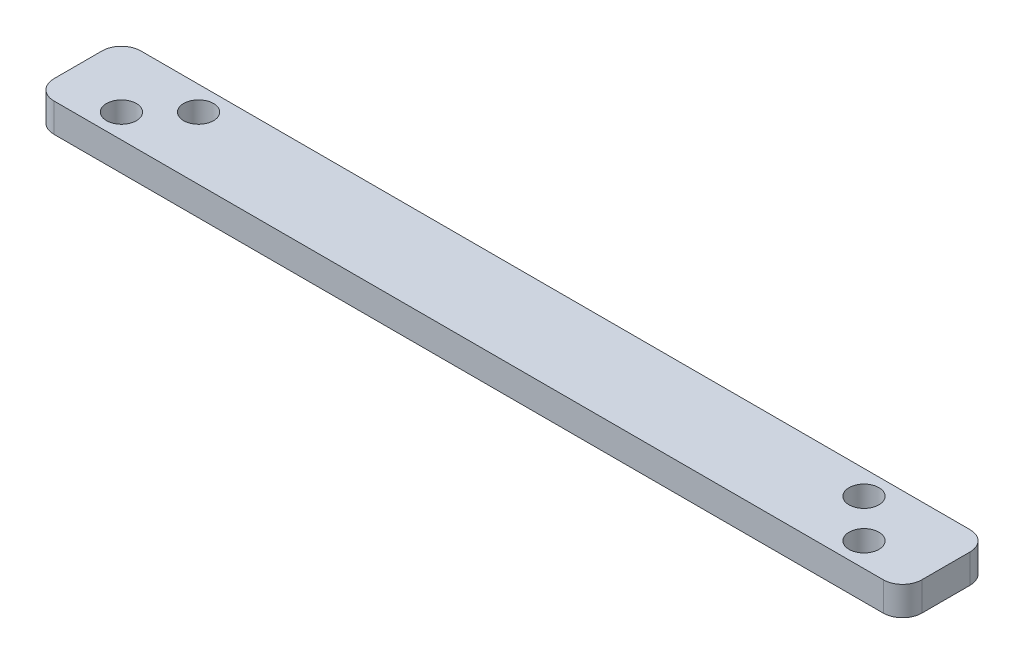
ISO-10303-21;
HEADER;
FILE_DESCRIPTION(('STEP AP214'),'2;1');
FILE_NAME('part.step','',(''),(''),'','','');
FILE_SCHEMA(('AUTOMOTIVE_DESIGN { 1 0 10303 214 1 1 1 1 }'));
ENDSEC;
DATA;
#1=APPLICATION_CONTEXT('core data for automotive mechanical design processes');
#2=APPLICATION_PROTOCOL_DEFINITION('international standard','automotive_design',2000,#1);
#3=PRODUCT_CONTEXT('',#1,'mechanical');
#4=PRODUCT('Part','Part','',(#3));
#5=PRODUCT_RELATED_PRODUCT_CATEGORY('part','',(#4));
#6=PRODUCT_DEFINITION_FORMATION('','',#4);
#7=PRODUCT_DEFINITION_CONTEXT('part definition',#1,'design');
#8=PRODUCT_DEFINITION('design','',#6,#7);
#9=PRODUCT_DEFINITION_SHAPE('','',#8);
#10=(LENGTH_UNIT() NAMED_UNIT(*) SI_UNIT(.MILLI.,.METRE.));
#11=(NAMED_UNIT(*) PLANE_ANGLE_UNIT() SI_UNIT($,.RADIAN.));
#12=(NAMED_UNIT(*) SI_UNIT($,.STERADIAN.) SOLID_ANGLE_UNIT());
#13=UNCERTAINTY_MEASURE_WITH_UNIT(LENGTH_MEASURE(1.E-05),#10,'distance_accuracy_value','');
#14=(GEOMETRIC_REPRESENTATION_CONTEXT(3) GLOBAL_UNCERTAINTY_ASSIGNED_CONTEXT((#13)) GLOBAL_UNIT_ASSIGNED_CONTEXT((#10,
#11,#12)) REPRESENTATION_CONTEXT('',''));
#15=CARTESIAN_POINT('',(0.,0.,0.));
#16=DIRECTION('',(0.,0.,1.));
#17=DIRECTION('',(1.,0.,0.));
#18=AXIS2_PLACEMENT_3D('',#15,#16,#17);
#19=CARTESIAN_POINT('',(0.,3.,0.));
#20=DIRECTION('',(0.,-1.,0.));
#21=DIRECTION('',(0.,0.,-1.));
#22=AXIS2_PLACEMENT_3D('',#19,#20,#21);
#23=PLANE('',#22);
#24=DIRECTION('',(0.,0.,-1.));
#25=VECTOR('',#24,1.);
#26=CARTESIAN_POINT('',(45.,3.,4.5));
#27=LINE('',#26,#25);
#28=CARTESIAN_POINT('',(45.,3.,2.5));
#29=VERTEX_POINT('',#28);
#30=CARTESIAN_POINT('',(45.,3.,-2.5));
#31=VERTEX_POINT('',#30);
#32=EDGE_CURVE('E143',#29,#31,#27,.T.);
#33=ORIENTED_EDGE('',*,*,#32,.T.);
#34=CARTESIAN_POINT('',(43.,3.,-2.5));
#35=DIRECTION('',(0.,-1.,0.));
#36=DIRECTION('',(0.,0.,-1.));
#37=AXIS2_PLACEMENT_3D('',#34,#35,#36);
#38=CIRCLE('',#37,2.);
#39=CARTESIAN_POINT('',(43.,3.,-4.5));
#40=VERTEX_POINT('',#39);
#41=EDGE_CURVE('E157',#31,#40,#38,.F.);
#42=ORIENTED_EDGE('',*,*,#41,.T.);
#43=DIRECTION('',(-1.,0.,0.));
#44=VECTOR('',#43,1.);
#45=CARTESIAN_POINT('',(-45.,3.,-4.5));
#46=LINE('',#45,#44);
#47=CARTESIAN_POINT('',(-43.,3.,-4.5));
#48=VERTEX_POINT('',#47);
#49=EDGE_CURVE('E124',#40,#48,#46,.T.);
#50=ORIENTED_EDGE('',*,*,#49,.T.);
#51=CARTESIAN_POINT('',(-43.,3.,-2.5));
#52=DIRECTION('',(0.,-1.,0.));
#53=DIRECTION('',(0.,0.,-1.));
#54=AXIS2_PLACEMENT_3D('',#51,#52,#53);
#55=CIRCLE('',#54,2.);
#56=CARTESIAN_POINT('',(-45.,3.,-2.5));
#57=VERTEX_POINT('',#56);
#58=EDGE_CURVE('E153',#48,#57,#55,.F.);
#59=ORIENTED_EDGE('',*,*,#58,.T.);
#60=DIRECTION('',(0.,0.,1.));
#61=VECTOR('',#60,1.);
#62=CARTESIAN_POINT('',(-45.,3.,4.5));
#63=LINE('',#62,#61);
#64=CARTESIAN_POINT('',(-45.,3.,2.5));
#65=VERTEX_POINT('',#64);
#66=EDGE_CURVE('E166',#57,#65,#63,.T.);
#67=ORIENTED_EDGE('',*,*,#66,.T.);
#68=CARTESIAN_POINT('',(-43.,3.,2.5));
#69=DIRECTION('',(0.,-1.,0.));
#70=DIRECTION('',(0.,0.,-1.));
#71=AXIS2_PLACEMENT_3D('',#68,#69,#70);
#72=CIRCLE('',#71,2.);
#73=CARTESIAN_POINT('',(-43.,3.,4.5));
#74=VERTEX_POINT('',#73);
#75=EDGE_CURVE('E59',#65,#74,#72,.F.);
#76=ORIENTED_EDGE('',*,*,#75,.T.);
#77=DIRECTION('',(1.,0.,0.));
#78=VECTOR('',#77,1.);
#79=CARTESIAN_POINT('',(-45.,3.,4.5));
#80=LINE('',#79,#78);
#81=CARTESIAN_POINT('',(43.,3.,4.5));
#82=VERTEX_POINT('',#81);
#83=EDGE_CURVE('E144',#74,#82,#80,.T.);
#84=ORIENTED_EDGE('',*,*,#83,.T.);
#85=CARTESIAN_POINT('',(43.,3.,2.5));
#86=DIRECTION('',(0.,-1.,0.));
#87=DIRECTION('',(0.,0.,-1.));
#88=AXIS2_PLACEMENT_3D('',#85,#86,#87);
#89=CIRCLE('',#88,2.);
#90=EDGE_CURVE('E155',#82,#29,#89,.F.);
#91=ORIENTED_EDGE('',*,*,#90,.T.);
#92=EDGE_LOOP('',(#33,#42,#50,#59,#67,#76,#84,#91));
#93=FACE_BOUND('',#92,.T.);
#94=CARTESIAN_POINT('',(-38.5,3.,2.));
#95=DIRECTION('',(0.,1.,0.));
#96=DIRECTION('',(0.,0.,1.));
#97=AXIS2_PLACEMENT_3D('',#94,#95,#96);
#98=CIRCLE('',#97,1.55);
#99=CARTESIAN_POINT('',(-38.5,3.,3.55000000000001));
#100=VERTEX_POINT('',#99);
#101=EDGE_CURVE('E138',#100,#100,#98,.T.);
#102=ORIENTED_EDGE('',*,*,#101,.F.);
#103=EDGE_LOOP('',(#102));
#104=FACE_BOUND('',#103,.T.);
#105=CARTESIAN_POINT('',(-34.5,3.,-2.));
#106=DIRECTION('',(0.,1.,0.));
#107=DIRECTION('',(0.,0.,1.));
#108=AXIS2_PLACEMENT_3D('',#105,#106,#107);
#109=CIRCLE('',#108,1.55);
#110=CARTESIAN_POINT('',(-34.5,3.,-0.449999999999994));
#111=VERTEX_POINT('',#110);
#112=EDGE_CURVE('E189',#111,#111,#109,.T.);
#113=ORIENTED_EDGE('',*,*,#112,.F.);
#114=EDGE_LOOP('',(#113));
#115=FACE_BOUND('',#114,.T.);
#116=CARTESIAN_POINT('',(38.5,3.,2.));
#117=DIRECTION('',(0.,1.,0.));
#118=DIRECTION('',(0.,0.,-1.));
#119=AXIS2_PLACEMENT_3D('',#116,#117,#118);
#120=CIRCLE('',#119,1.55);
#121=CARTESIAN_POINT('',(38.5,3.,0.450000000000004));
#122=VERTEX_POINT('',#121);
#123=EDGE_CURVE('E195',#122,#122,#120,.T.);
#124=ORIENTED_EDGE('',*,*,#123,.F.);
#125=EDGE_LOOP('',(#124));
#126=FACE_BOUND('',#125,.T.);
#127=CARTESIAN_POINT('',(34.5,3.,-2.));
#128=DIRECTION('',(0.,1.,0.));
#129=DIRECTION('',(0.,0.,-1.));
#130=AXIS2_PLACEMENT_3D('',#127,#128,#129);
#131=CIRCLE('',#130,1.55);
#132=CARTESIAN_POINT('',(34.5,3.,-3.55));
#133=VERTEX_POINT('',#132);
#134=EDGE_CURVE('E201',#133,#133,#131,.T.);
#135=ORIENTED_EDGE('',*,*,#134,.F.);
#136=EDGE_LOOP('',(#135));
#137=FACE_BOUND('',#136,.T.);
#138=ADVANCED_FACE('F37',(#93,#104,#115,#126,#137),#23,.F.);
#139=CARTESIAN_POINT('',(0.,0.,0.));
#140=DIRECTION('',(0.,-1.,0.));
#141=DIRECTION('',(0.,0.,-1.));
#142=AXIS2_PLACEMENT_3D('',#139,#140,#141);
#143=PLANE('',#142);
#144=CARTESIAN_POINT('',(38.5,0.,2.));
#145=DIRECTION('',(0.,1.,0.));
#146=DIRECTION('',(0.,0.,-1.));
#147=AXIS2_PLACEMENT_3D('',#144,#145,#146);
#148=CIRCLE('',#147,1.55);
#149=CARTESIAN_POINT('',(38.5,0.,0.450000000000004));
#150=VERTEX_POINT('',#149);
#151=EDGE_CURVE('E198',#150,#150,#148,.T.);
#152=ORIENTED_EDGE('',*,*,#151,.T.);
#153=EDGE_LOOP('',(#152));
#154=FACE_BOUND('',#153,.T.);
#155=CARTESIAN_POINT('',(-38.5,0.,2.));
#156=DIRECTION('',(0.,1.,0.));
#157=DIRECTION('',(0.,0.,1.));
#158=AXIS2_PLACEMENT_3D('',#155,#156,#157);
#159=CIRCLE('',#158,1.55);
#160=CARTESIAN_POINT('',(-38.5,0.,3.55000000000001));
#161=VERTEX_POINT('',#160);
#162=EDGE_CURVE('E186',#161,#161,#159,.T.);
#163=ORIENTED_EDGE('',*,*,#162,.T.);
#164=EDGE_LOOP('',(#163));
#165=FACE_BOUND('',#164,.T.);
#166=DIRECTION('',(-1.,0.,0.));
#167=VECTOR('',#166,1.);
#168=CARTESIAN_POINT('',(-45.,0.,-4.5));
#169=LINE('',#168,#167);
#170=CARTESIAN_POINT('',(43.,0.,-4.5));
#171=VERTEX_POINT('',#170);
#172=CARTESIAN_POINT('',(-43.,0.,-4.5));
#173=VERTEX_POINT('',#172);
#174=EDGE_CURVE('E121',#171,#173,#169,.T.);
#175=ORIENTED_EDGE('',*,*,#174,.F.);
#176=CARTESIAN_POINT('',(43.,0.,-2.5));
#177=DIRECTION('',(0.,-1.,0.));
#178=DIRECTION('',(0.,0.,-1.));
#179=AXIS2_PLACEMENT_3D('',#176,#177,#178);
#180=CIRCLE('',#179,2.);
#181=CARTESIAN_POINT('',(45.,0.,-2.5));
#182=VERTEX_POINT('',#181);
#183=EDGE_CURVE('E104',#171,#182,#180,.T.);
#184=ORIENTED_EDGE('',*,*,#183,.T.);
#185=DIRECTION('',(0.,0.,-1.));
#186=VECTOR('',#185,1.);
#187=CARTESIAN_POINT('',(45.,0.,4.5));
#188=LINE('',#187,#186);
#189=CARTESIAN_POINT('',(45.,0.,2.5));
#190=VERTEX_POINT('',#189);
#191=EDGE_CURVE('E133',#190,#182,#188,.T.);
#192=ORIENTED_EDGE('',*,*,#191,.F.);
#193=CARTESIAN_POINT('',(43.,0.,2.5));
#194=DIRECTION('',(0.,-1.,0.));
#195=DIRECTION('',(0.,0.,-1.));
#196=AXIS2_PLACEMENT_3D('',#193,#194,#195);
#197=CIRCLE('',#196,2.);
#198=CARTESIAN_POINT('',(43.,0.,4.5));
#199=VERTEX_POINT('',#198);
#200=EDGE_CURVE('E115',#190,#199,#197,.T.);
#201=ORIENTED_EDGE('',*,*,#200,.T.);
#202=DIRECTION('',(1.,0.,0.));
#203=VECTOR('',#202,1.);
#204=CARTESIAN_POINT('',(-45.,0.,4.5));
#205=LINE('',#204,#203);
#206=CARTESIAN_POINT('',(-43.,0.,4.5));
#207=VERTEX_POINT('',#206);
#208=EDGE_CURVE('E136',#207,#199,#205,.T.);
#209=ORIENTED_EDGE('',*,*,#208,.F.);
#210=CARTESIAN_POINT('',(-43.,0.,2.5));
#211=DIRECTION('',(0.,-1.,0.));
#212=DIRECTION('',(0.,0.,-1.));
#213=AXIS2_PLACEMENT_3D('',#210,#211,#212);
#214=CIRCLE('',#213,2.);
#215=CARTESIAN_POINT('',(-45.,0.,2.5));
#216=VERTEX_POINT('',#215);
#217=EDGE_CURVE('E125',#207,#216,#214,.T.);
#218=ORIENTED_EDGE('',*,*,#217,.T.);
#219=DIRECTION('',(0.,0.,1.));
#220=VECTOR('',#219,1.);
#221=CARTESIAN_POINT('',(-45.,0.,4.5));
#222=LINE('',#221,#220);
#223=CARTESIAN_POINT('',(-45.,0.,-2.5));
#224=VERTEX_POINT('',#223);
#225=EDGE_CURVE('E132',#224,#216,#222,.T.);
#226=ORIENTED_EDGE('',*,*,#225,.F.);
#227=CARTESIAN_POINT('',(-43.,0.,-2.5));
#228=DIRECTION('',(0.,-1.,0.));
#229=DIRECTION('',(0.,0.,-1.));
#230=AXIS2_PLACEMENT_3D('',#227,#228,#229);
#231=CIRCLE('',#230,2.);
#232=EDGE_CURVE('E131',#224,#173,#231,.T.);
#233=ORIENTED_EDGE('',*,*,#232,.T.);
#234=EDGE_LOOP('',(#175,#184,#192,#201,#209,#218,#226,#233));
#235=FACE_BOUND('',#234,.T.);
#236=CARTESIAN_POINT('',(-34.5,0.,-2.));
#237=DIRECTION('',(0.,1.,0.));
#238=DIRECTION('',(0.,0.,1.));
#239=AXIS2_PLACEMENT_3D('',#236,#237,#238);
#240=CIRCLE('',#239,1.55);
#241=CARTESIAN_POINT('',(-34.5,0.,-0.449999999999994));
#242=VERTEX_POINT('',#241);
#243=EDGE_CURVE('E192',#242,#242,#240,.T.);
#244=ORIENTED_EDGE('',*,*,#243,.T.);
#245=EDGE_LOOP('',(#244));
#246=FACE_BOUND('',#245,.T.);
#247=CARTESIAN_POINT('',(34.5,0.,-2.));
#248=DIRECTION('',(0.,1.,0.));
#249=DIRECTION('',(0.,0.,-1.));
#250=AXIS2_PLACEMENT_3D('',#247,#248,#249);
#251=CIRCLE('',#250,1.55);
#252=CARTESIAN_POINT('',(34.5,0.,-3.55));
#253=VERTEX_POINT('',#252);
#254=EDGE_CURVE('E204',#253,#253,#251,.T.);
#255=ORIENTED_EDGE('',*,*,#254,.T.);
#256=EDGE_LOOP('',(#255));
#257=FACE_BOUND('',#256,.T.);
#258=ADVANCED_FACE('F128',(#154,#165,#235,#246,#257),#143,.T.);
#259=CARTESIAN_POINT('',(45.,3.,4.5));
#260=DIRECTION('',(-1.,0.,0.));
#261=DIRECTION('',(0.,0.,1.));
#262=AXIS2_PLACEMENT_3D('',#259,#260,#261);
#263=PLANE('',#262);
#264=ORIENTED_EDGE('',*,*,#191,.T.);
#265=DIRECTION('',(0.,-1.,0.));
#266=VECTOR('',#265,1.);
#267=CARTESIAN_POINT('',(45.,3.,-2.5));
#268=LINE('',#267,#266);
#269=EDGE_CURVE('E109',#182,#31,#268,.F.);
#270=ORIENTED_EDGE('',*,*,#269,.T.);
#271=ORIENTED_EDGE('',*,*,#32,.F.);
#272=DIRECTION('',(0.,-1.,0.));
#273=VECTOR('',#272,1.);
#274=CARTESIAN_POINT('',(45.,3.,2.5));
#275=LINE('',#274,#273);
#276=EDGE_CURVE('E114',#29,#190,#275,.T.);
#277=ORIENTED_EDGE('',*,*,#276,.T.);
#278=EDGE_LOOP('',(#264,#270,#271,#277));
#279=FACE_BOUND('',#278,.T.);
#280=ADVANCED_FACE('F182',(#279),#263,.F.);
#281=CARTESIAN_POINT('',(-45.,3.,-4.5));
#282=DIRECTION('',(0.,0.,1.));
#283=DIRECTION('',(1.,0.,0.));
#284=AXIS2_PLACEMENT_3D('',#281,#282,#283);
#285=PLANE('',#284);
#286=ORIENTED_EDGE('',*,*,#49,.F.);
#287=DIRECTION('',(0.,-1.,0.));
#288=VECTOR('',#287,1.);
#289=CARTESIAN_POINT('',(43.,3.,-4.5));
#290=LINE('',#289,#288);
#291=EDGE_CURVE('E108',#40,#171,#290,.T.);
#292=ORIENTED_EDGE('',*,*,#291,.T.);
#293=ORIENTED_EDGE('',*,*,#174,.T.);
#294=DIRECTION('',(0.,-1.,0.));
#295=VECTOR('',#294,1.);
#296=CARTESIAN_POINT('',(-43.,3.,-4.5));
#297=LINE('',#296,#295);
#298=EDGE_CURVE('E126',#173,#48,#297,.F.);
#299=ORIENTED_EDGE('',*,*,#298,.T.);
#300=EDGE_LOOP('',(#286,#292,#293,#299));
#301=FACE_BOUND('',#300,.T.);
#302=ADVANCED_FACE('F120',(#301),#285,.F.);
#303=CARTESIAN_POINT('',(-45.,3.,4.5));
#304=DIRECTION('',(1.,0.,0.));
#305=DIRECTION('',(0.,0.,-1.));
#306=AXIS2_PLACEMENT_3D('',#303,#304,#305);
#307=PLANE('',#306);
#308=ORIENTED_EDGE('',*,*,#66,.F.);
#309=DIRECTION('',(0.,-1.,0.));
#310=VECTOR('',#309,1.);
#311=CARTESIAN_POINT('',(-45.,3.,-2.5));
#312=LINE('',#311,#310);
#313=EDGE_CURVE('E11',#57,#224,#312,.T.);
#314=ORIENTED_EDGE('',*,*,#313,.T.);
#315=ORIENTED_EDGE('',*,*,#225,.T.);
#316=DIRECTION('',(0.,-1.,0.));
#317=VECTOR('',#316,1.);
#318=CARTESIAN_POINT('',(-45.,3.,2.5));
#319=LINE('',#318,#317);
#320=EDGE_CURVE('E45',#216,#65,#319,.F.);
#321=ORIENTED_EDGE('',*,*,#320,.T.);
#322=EDGE_LOOP('',(#308,#314,#315,#321));
#323=FACE_BOUND('',#322,.T.);
#324=ADVANCED_FACE('F165',(#323),#307,.F.);
#325=CARTESIAN_POINT('',(-45.,3.,4.5));
#326=DIRECTION('',(0.,0.,-1.));
#327=DIRECTION('',(-1.,0.,0.));
#328=AXIS2_PLACEMENT_3D('',#325,#326,#327);
#329=PLANE('',#328);
#330=ORIENTED_EDGE('',*,*,#208,.T.);
#331=DIRECTION('',(0.,-1.,0.));
#332=VECTOR('',#331,1.);
#333=CARTESIAN_POINT('',(43.,3.,4.5));
#334=LINE('',#333,#332);
#335=EDGE_CURVE('E52',#199,#82,#334,.F.);
#336=ORIENTED_EDGE('',*,*,#335,.T.);
#337=ORIENTED_EDGE('',*,*,#83,.F.);
#338=DIRECTION('',(0.,-1.,0.));
#339=VECTOR('',#338,1.);
#340=CARTESIAN_POINT('',(-43.,3.,4.5));
#341=LINE('',#340,#339);
#342=EDGE_CURVE('E159',#74,#207,#341,.T.);
#343=ORIENTED_EDGE('',*,*,#342,.T.);
#344=EDGE_LOOP('',(#330,#336,#337,#343));
#345=FACE_BOUND('',#344,.T.);
#346=ADVANCED_FACE('F175',(#345),#329,.F.);
#347=CARTESIAN_POINT('',(-38.5,3.,2.));
#348=DIRECTION('',(0.,-1.,0.));
#349=DIRECTION('',(0.,0.,-1.));
#350=AXIS2_PLACEMENT_3D('',#347,#348,#349);
#351=CYLINDRICAL_SURFACE('',#350,1.55);
#352=ORIENTED_EDGE('',*,*,#101,.T.);
#353=EDGE_LOOP('',(#352));
#354=FACE_BOUND('',#353,.T.);
#355=ORIENTED_EDGE('',*,*,#162,.F.);
#356=EDGE_LOOP('',(#355));
#357=FACE_BOUND('',#356,.T.);
#358=ADVANCED_FACE('F221',(#354,#357),#351,.F.);
#359=CARTESIAN_POINT('',(-34.5,3.,-2.));
#360=DIRECTION('',(0.,-1.,0.));
#361=DIRECTION('',(0.,0.,-1.));
#362=AXIS2_PLACEMENT_3D('',#359,#360,#361);
#363=CYLINDRICAL_SURFACE('',#362,1.55);
#364=ORIENTED_EDGE('',*,*,#112,.T.);
#365=EDGE_LOOP('',(#364));
#366=FACE_BOUND('',#365,.T.);
#367=ORIENTED_EDGE('',*,*,#243,.F.);
#368=EDGE_LOOP('',(#367));
#369=FACE_BOUND('',#368,.T.);
#370=ADVANCED_FACE('F313',(#366,#369),#363,.F.);
#371=CARTESIAN_POINT('',(38.5,3.,2.));
#372=DIRECTION('',(0.,-1.,0.));
#373=DIRECTION('',(0.,0.,-1.));
#374=AXIS2_PLACEMENT_3D('',#371,#372,#373);
#375=CYLINDRICAL_SURFACE('',#374,1.55);
#376=ORIENTED_EDGE('',*,*,#123,.T.);
#377=EDGE_LOOP('',(#376));
#378=FACE_BOUND('',#377,.T.);
#379=ORIENTED_EDGE('',*,*,#151,.F.);
#380=EDGE_LOOP('',(#379));
#381=FACE_BOUND('',#380,.T.);
#382=ADVANCED_FACE('F304',(#378,#381),#375,.F.);
#383=CARTESIAN_POINT('',(34.5,3.,-2.));
#384=DIRECTION('',(0.,-1.,0.));
#385=DIRECTION('',(0.,0.,-1.));
#386=AXIS2_PLACEMENT_3D('',#383,#384,#385);
#387=CYLINDRICAL_SURFACE('',#386,1.55);
#388=ORIENTED_EDGE('',*,*,#134,.T.);
#389=EDGE_LOOP('',(#388));
#390=FACE_BOUND('',#389,.T.);
#391=ORIENTED_EDGE('',*,*,#254,.F.);
#392=EDGE_LOOP('',(#391));
#393=FACE_BOUND('',#392,.T.);
#394=ADVANCED_FACE('F210',(#390,#393),#387,.F.);
#395=CARTESIAN_POINT('',(43.,3.,-2.5));
#396=DIRECTION('',(0.,-1.,0.));
#397=DIRECTION('',(0.,0.,-1.));
#398=AXIS2_PLACEMENT_3D('',#395,#396,#397);
#399=CYLINDRICAL_SURFACE('',#398,2.);
#400=ORIENTED_EDGE('',*,*,#41,.F.);
#401=ORIENTED_EDGE('',*,*,#269,.F.);
#402=ORIENTED_EDGE('',*,*,#183,.F.);
#403=ORIENTED_EDGE('',*,*,#291,.F.);
#404=EDGE_LOOP('',(#400,#401,#402,#403));
#405=FACE_BOUND('',#404,.T.);
#406=ADVANCED_FACE('F107',(#405),#399,.T.);
#407=CARTESIAN_POINT('',(43.,3.,2.5));
#408=DIRECTION('',(0.,-1.,0.));
#409=DIRECTION('',(0.,0.,-1.));
#410=AXIS2_PLACEMENT_3D('',#407,#408,#409);
#411=CYLINDRICAL_SURFACE('',#410,2.);
#412=ORIENTED_EDGE('',*,*,#90,.F.);
#413=ORIENTED_EDGE('',*,*,#335,.F.);
#414=ORIENTED_EDGE('',*,*,#200,.F.);
#415=ORIENTED_EDGE('',*,*,#276,.F.);
#416=EDGE_LOOP('',(#412,#413,#414,#415));
#417=FACE_BOUND('',#416,.T.);
#418=ADVANCED_FACE('F179',(#417),#411,.T.);
#419=CARTESIAN_POINT('',(-43.,3.,-2.5));
#420=DIRECTION('',(0.,-1.,0.));
#421=DIRECTION('',(0.,0.,-1.));
#422=AXIS2_PLACEMENT_3D('',#419,#420,#421);
#423=CYLINDRICAL_SURFACE('',#422,2.);
#424=ORIENTED_EDGE('',*,*,#58,.F.);
#425=ORIENTED_EDGE('',*,*,#298,.F.);
#426=ORIENTED_EDGE('',*,*,#232,.F.);
#427=ORIENTED_EDGE('',*,*,#313,.F.);
#428=EDGE_LOOP('',(#424,#425,#426,#427));
#429=FACE_BOUND('',#428,.T.);
#430=ADVANCED_FACE('F235',(#429),#423,.T.);
#431=CARTESIAN_POINT('',(-43.,3.,2.5));
#432=DIRECTION('',(0.,-1.,0.));
#433=DIRECTION('',(0.,0.,-1.));
#434=AXIS2_PLACEMENT_3D('',#431,#432,#433);
#435=CYLINDRICAL_SURFACE('',#434,2.);
#436=ORIENTED_EDGE('',*,*,#75,.F.);
#437=ORIENTED_EDGE('',*,*,#320,.F.);
#438=ORIENTED_EDGE('',*,*,#217,.F.);
#439=ORIENTED_EDGE('',*,*,#342,.F.);
#440=EDGE_LOOP('',(#436,#437,#438,#439));
#441=FACE_BOUND('',#440,.T.);
#442=ADVANCED_FACE('F39',(#441),#435,.T.);
#443=CLOSED_SHELL('',(#138,#258,#280,#302,#324,#346,#358,#370,#382,#394,#406,#418,#430,#442));
#444=MANIFOLD_SOLID_BREP('B2',#443);
#445=ADVANCED_BREP_SHAPE_REPRESENTATION('',(#18,#444),#14);
#446=SHAPE_DEFINITION_REPRESENTATION(#9,#445);
ENDSEC;
END-ISO-10303-21;
